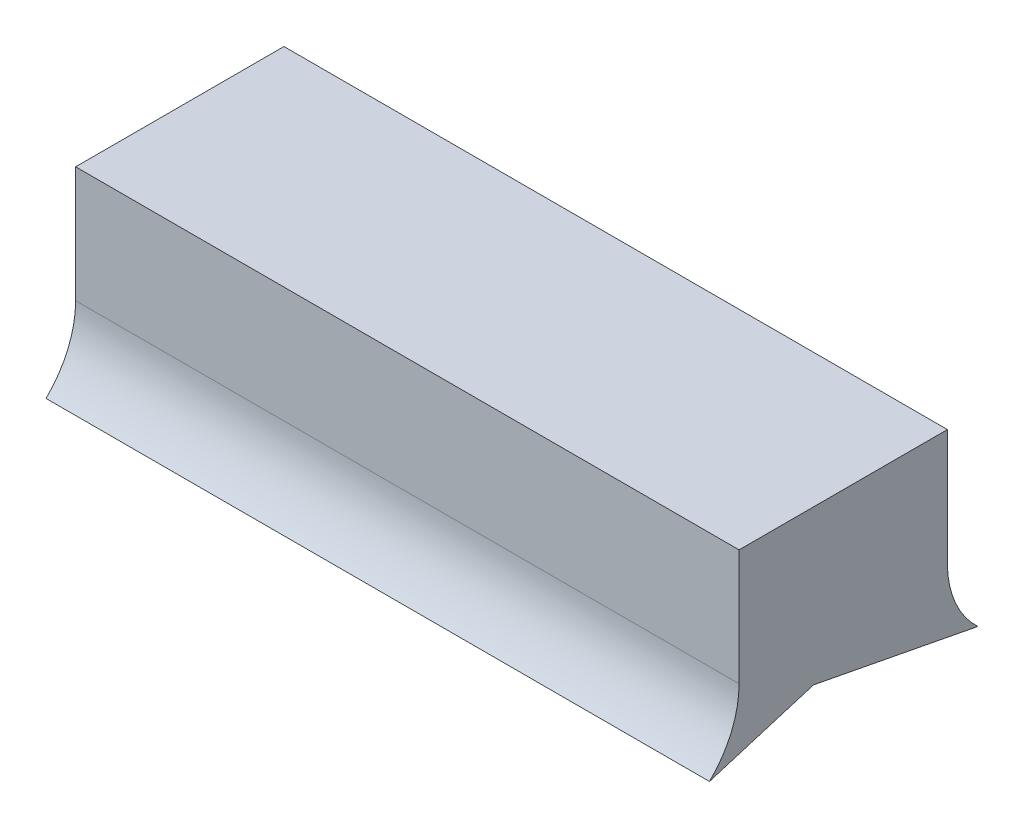
ISO-10303-21;
HEADER;
FILE_DESCRIPTION(('STEP AP214'),'2;1');
FILE_NAME('part.step','',(''),(''),'','','');
FILE_SCHEMA(('AUTOMOTIVE_DESIGN { 1 0 10303 214 1 1 1 1 }'));
ENDSEC;
DATA;
#1=APPLICATION_CONTEXT('core data for automotive mechanical design processes');
#2=APPLICATION_PROTOCOL_DEFINITION('international standard','automotive_design',2000,#1);
#3=PRODUCT_CONTEXT('',#1,'mechanical');
#4=PRODUCT('Part','Part','',(#3));
#5=PRODUCT_RELATED_PRODUCT_CATEGORY('part','',(#4));
#6=PRODUCT_DEFINITION_FORMATION('','',#4);
#7=PRODUCT_DEFINITION_CONTEXT('part definition',#1,'design');
#8=PRODUCT_DEFINITION('design','',#6,#7);
#9=PRODUCT_DEFINITION_SHAPE('','',#8);
#10=(LENGTH_UNIT() NAMED_UNIT(*) SI_UNIT(.MILLI.,.METRE.));
#11=(NAMED_UNIT(*) PLANE_ANGLE_UNIT() SI_UNIT($,.RADIAN.));
#12=(NAMED_UNIT(*) SI_UNIT($,.STERADIAN.) SOLID_ANGLE_UNIT());
#13=UNCERTAINTY_MEASURE_WITH_UNIT(LENGTH_MEASURE(1.E-05),#10,'distance_accuracy_value','');
#14=(GEOMETRIC_REPRESENTATION_CONTEXT(3) GLOBAL_UNCERTAINTY_ASSIGNED_CONTEXT((#13)) GLOBAL_UNIT_ASSIGNED_CONTEXT((#10,
#11,#12)) REPRESENTATION_CONTEXT('',''));
#15=CARTESIAN_POINT('',(0.,0.,0.));
#16=DIRECTION('',(0.,0.,1.));
#17=DIRECTION('',(1.,0.,0.));
#18=AXIS2_PLACEMENT_3D('',#15,#16,#17);
#19=CARTESIAN_POINT('',(170.671419331303,41.5041899340334,-98.0364451428921));
#20=DIRECTION('',(-1.,0.,0.));
#21=DIRECTION('',(0.,1.,0.));
#22=AXIS2_PLACEMENT_3D('',#19,#20,#21);
#23=PLANE('',#22);
#24=DIRECTION('',(0.,0.,1.));
#25=VECTOR('',#24,1.);
#26=CARTESIAN_POINT('',(170.671419331303,69.1541899340334,-121.186445142892));
#27=LINE('',#26,#25);
#28=CARTESIAN_POINT('',(170.671419331303,69.1541899340334,-170.862073157747));
#29=VERTEX_POINT('',#28);
#30=CARTESIAN_POINT('',(170.671419331303,69.1541899340334,-121.186445142892));
#31=VERTEX_POINT('',#30);
#32=EDGE_CURVE('E45',#29,#31,#27,.T.);
#33=ORIENTED_EDGE('',*,*,#32,.F.);
#34=DIRECTION('',(0.,1.,0.));
#35=VECTOR('',#34,1.);
#36=CARTESIAN_POINT('',(170.671419331303,69.1541899340333,-170.862073157747));
#37=LINE('',#36,#35);
#38=CARTESIAN_POINT('',(170.671419331303,41.5041899340334,-170.862073157747));
#39=VERTEX_POINT('',#38);
#40=EDGE_CURVE('E125',#39,#29,#37,.T.);
#41=ORIENTED_EDGE('',*,*,#40,.F.);
#42=CARTESIAN_POINT('',(170.671419331303,41.5041899340333,-193.512073157747));
#43=DIRECTION('',(-1.,0.,0.));
#44=DIRECTION('',(0.,-1.,0.));
#45=AXIS2_PLACEMENT_3D('',#42,#43,#44);
#46=CIRCLE('',#45,22.65);
#47=CARTESIAN_POINT('',(170.671419331303,24.8541899340334,-178.156292487263));
#48=VERTEX_POINT('',#47);
#49=EDGE_CURVE('E129',#48,#39,#46,.T.);
#50=ORIENTED_EDGE('',*,*,#49,.F.);
#51=DIRECTION('',(0.,-0.188677963490101,-0.9820390145474));
#52=VECTOR('',#51,1.);
#53=CARTESIAN_POINT('',(170.671419331303,32.389389728341,-138.936767093096));
#54=LINE('',#53,#52);
#55=CARTESIAN_POINT('',(170.671419331303,32.389389728341,-138.936767093096));
#56=VERTEX_POINT('',#55);
#57=EDGE_CURVE('E133',#56,#48,#54,.T.);
#58=ORIENTED_EDGE('',*,*,#57,.F.);
#59=DIRECTION('',(0.,0.290542331892302,-0.956862139170833));
#60=VECTOR('',#59,1.);
#61=CARTESIAN_POINT('',(170.671419331303,24.8541899340333,-114.120598835269));
#62=LINE('',#61,#60);
#63=CARTESIAN_POINT('',(170.671419331303,24.8541899340334,-114.120598835269));
#64=VERTEX_POINT('',#63);
#65=EDGE_CURVE('E77',#64,#56,#62,.T.);
#66=ORIENTED_EDGE('',*,*,#65,.F.);
#67=CARTESIAN_POINT('',(170.671419331303,41.5041899340334,-98.0364451428921));
#68=DIRECTION('',(-1.,0.,0.));
#69=DIRECTION('',(0.,-1.,0.));
#70=AXIS2_PLACEMENT_3D('',#67,#68,#69);
#71=CIRCLE('',#70,23.15);
#72=CARTESIAN_POINT('',(170.671419331303,41.5041899340334,-121.186445142892));
#73=VERTEX_POINT('',#72);
#74=EDGE_CURVE('E82',#73,#64,#71,.T.);
#75=ORIENTED_EDGE('',*,*,#74,.F.);
#76=DIRECTION('',(0.,-1.,0.));
#77=VECTOR('',#76,1.);
#78=CARTESIAN_POINT('',(170.671419331303,69.1541899340333,-121.186445142892));
#79=LINE('',#78,#77);
#80=EDGE_CURVE('E106',#31,#73,#79,.T.);
#81=ORIENTED_EDGE('',*,*,#80,.F.);
#82=EDGE_LOOP('',(#33,#41,#50,#58,#66,#75,#81));
#83=FACE_BOUND('',#82,.T.);
#84=ADVANCED_FACE('F37',(#83),#23,.T.);
#85=CARTESIAN_POINT('',(328.871419331303,41.5041899340334,-193.512073157747));
#86=DIRECTION('',(1.,0.,0.));
#87=DIRECTION('',(0.,1.,0.));
#88=AXIS2_PLACEMENT_3D('',#85,#86,#87);
#89=PLANE('',#88);
#90=DIRECTION('',(0.,0.,1.));
#91=VECTOR('',#90,1.);
#92=CARTESIAN_POINT('',(328.871419331303,69.1541899340334,-121.186445142892));
#93=LINE('',#92,#91);
#94=CARTESIAN_POINT('',(328.871419331303,69.1541899340334,-170.862073157747));
#95=VERTEX_POINT('',#94);
#96=CARTESIAN_POINT('',(328.871419331303,69.1541899340334,-121.186445142892));
#97=VERTEX_POINT('',#96);
#98=EDGE_CURVE('E116',#95,#97,#93,.T.);
#99=ORIENTED_EDGE('',*,*,#98,.T.);
#100=DIRECTION('',(0.,-1.,0.));
#101=VECTOR('',#100,1.);
#102=CARTESIAN_POINT('',(328.871419331303,69.1541899340334,-121.186445142892));
#103=LINE('',#102,#101);
#104=CARTESIAN_POINT('',(328.871419331303,41.5041899340335,-121.186445142892));
#105=VERTEX_POINT('',#104);
#106=EDGE_CURVE('E104',#97,#105,#103,.T.);
#107=ORIENTED_EDGE('',*,*,#106,.T.);
#108=CARTESIAN_POINT('',(328.871419331303,41.5041899340335,-98.0364451428922));
#109=DIRECTION('',(-1.,0.,0.));
#110=DIRECTION('',(0.,-1.,0.));
#111=AXIS2_PLACEMENT_3D('',#108,#109,#110);
#112=CIRCLE('',#111,23.15);
#113=CARTESIAN_POINT('',(328.871419331303,24.8541899340334,-114.120598835269));
#114=VERTEX_POINT('',#113);
#115=EDGE_CURVE('E108',#105,#114,#112,.T.);
#116=ORIENTED_EDGE('',*,*,#115,.T.);
#117=DIRECTION('',(0.,0.290542331892302,-0.956862139170833));
#118=VECTOR('',#117,1.);
#119=CARTESIAN_POINT('',(328.871419331303,24.8541899340334,-114.120598835269));
#120=LINE('',#119,#118);
#121=CARTESIAN_POINT('',(328.871419331303,32.3893897283411,-138.936767093096));
#122=VERTEX_POINT('',#121);
#123=EDGE_CURVE('E112',#114,#122,#120,.T.);
#124=ORIENTED_EDGE('',*,*,#123,.T.);
#125=DIRECTION('',(0.,-0.188677963490101,-0.9820390145474));
#126=VECTOR('',#125,1.);
#127=CARTESIAN_POINT('',(328.871419331303,32.3893897283411,-138.936767093096));
#128=LINE('',#127,#126);
#129=CARTESIAN_POINT('',(328.871419331303,24.8541899340334,-178.156292487263));
#130=VERTEX_POINT('',#129);
#131=EDGE_CURVE('E149',#122,#130,#128,.T.);
#132=ORIENTED_EDGE('',*,*,#131,.T.);
#133=CARTESIAN_POINT('',(328.871419331303,41.5041899340334,-193.512073157747));
#134=DIRECTION('',(-1.,0.,0.));
#135=DIRECTION('',(0.,1.,0.));
#136=AXIS2_PLACEMENT_3D('',#133,#134,#135);
#137=CIRCLE('',#136,22.65);
#138=CARTESIAN_POINT('',(328.871419331303,41.5041899340334,-170.862073157747));
#139=VERTEX_POINT('',#138);
#140=EDGE_CURVE('E154',#130,#139,#137,.T.);
#141=ORIENTED_EDGE('',*,*,#140,.T.);
#142=DIRECTION('',(0.,1.,0.));
#143=VECTOR('',#142,1.);
#144=CARTESIAN_POINT('',(328.871419331303,69.1541899340334,-170.862073157747));
#145=LINE('',#144,#143);
#146=EDGE_CURVE('E122',#139,#95,#145,.T.);
#147=ORIENTED_EDGE('',*,*,#146,.T.);
#148=EDGE_LOOP('',(#99,#107,#116,#124,#132,#141,#147));
#149=FACE_BOUND('',#148,.T.);
#150=ADVANCED_FACE('F114',(#149),#89,.T.);
#151=CARTESIAN_POINT('',(92.8057654042216,69.1541899340333,-121.186445142892));
#152=DIRECTION('',(0.,0.,1.));
#153=DIRECTION('',(1.,0.,0.));
#154=AXIS2_PLACEMENT_3D('',#151,#152,#153);
#155=PLANE('',#154);
#156=DIRECTION('',(1.,0.,0.));
#157=VECTOR('',#156,1.);
#158=CARTESIAN_POINT('',(92.8057654042216,69.1541899340333,-121.186445142892));
#159=LINE('',#158,#157);
#160=EDGE_CURVE('E11',#31,#97,#159,.T.);
#161=ORIENTED_EDGE('',*,*,#160,.F.);
#162=ORIENTED_EDGE('',*,*,#80,.T.);
#163=DIRECTION('',(1.,0.,0.));
#164=VECTOR('',#163,1.);
#165=CARTESIAN_POINT('',(92.8057654042216,41.5041899340334,-121.186445142892));
#166=LINE('',#165,#164);
#167=EDGE_CURVE('E101',#73,#105,#166,.T.);
#168=ORIENTED_EDGE('',*,*,#167,.T.);
#169=ORIENTED_EDGE('',*,*,#106,.F.);
#170=EDGE_LOOP('',(#161,#162,#168,#169));
#171=FACE_BOUND('',#170,.T.);
#172=ADVANCED_FACE('F102',(#171),#155,.T.);
#173=CARTESIAN_POINT('',(92.8057654042216,41.5041899340334,-98.0364451428921));
#174=DIRECTION('',(1.,0.,0.));
#175=DIRECTION('',(0.,1.,0.));
#176=AXIS2_PLACEMENT_3D('',#173,#174,#175);
#177=CYLINDRICAL_SURFACE('',#176,23.15);
#178=ORIENTED_EDGE('',*,*,#167,.F.);
#179=ORIENTED_EDGE('',*,*,#74,.T.);
#180=DIRECTION('',(1.,0.,0.));
#181=VECTOR('',#180,1.);
#182=CARTESIAN_POINT('',(92.8057654042216,24.8541899340333,-114.120598835269));
#183=LINE('',#182,#181);
#184=EDGE_CURVE('E96',#64,#114,#183,.T.);
#185=ORIENTED_EDGE('',*,*,#184,.T.);
#186=ORIENTED_EDGE('',*,*,#115,.F.);
#187=EDGE_LOOP('',(#178,#179,#185,#186));
#188=FACE_BOUND('',#187,.T.);
#189=ADVANCED_FACE('F109',(#188),#177,.F.);
#190=CARTESIAN_POINT('',(92.8057654042216,24.8541899340333,-114.120598835269));
#191=DIRECTION('',(0.,-0.956862139170833,-0.290542331892302));
#192=DIRECTION('',(0.,0.290542331892302,-0.956862139170833));
#193=AXIS2_PLACEMENT_3D('',#190,#191,#192);
#194=PLANE('',#193);
#195=ORIENTED_EDGE('',*,*,#184,.F.);
#196=ORIENTED_EDGE('',*,*,#65,.T.);
#197=DIRECTION('',(1.,0.,0.));
#198=VECTOR('',#197,1.);
#199=CARTESIAN_POINT('',(92.8057654042216,32.389389728341,-138.936767093096));
#200=LINE('',#199,#198);
#201=EDGE_CURVE('E136',#56,#122,#200,.T.);
#202=ORIENTED_EDGE('',*,*,#201,.T.);
#203=ORIENTED_EDGE('',*,*,#123,.F.);
#204=EDGE_LOOP('',(#195,#196,#202,#203));
#205=FACE_BOUND('',#204,.T.);
#206=ADVANCED_FACE('F146',(#205),#194,.T.);
#207=CARTESIAN_POINT('',(92.8057654042216,32.389389728341,-138.936767093096));
#208=DIRECTION('',(0.,-0.9820390145474,0.188677963490101));
#209=DIRECTION('',(0.,-0.188677963490101,-0.9820390145474));
#210=AXIS2_PLACEMENT_3D('',#207,#208,#209);
#211=PLANE('',#210);
#212=ORIENTED_EDGE('',*,*,#201,.F.);
#213=ORIENTED_EDGE('',*,*,#57,.T.);
#214=DIRECTION('',(1.,0.,0.));
#215=VECTOR('',#214,1.);
#216=CARTESIAN_POINT('',(92.8057654042216,24.8541899340333,-178.156292487263));
#217=LINE('',#216,#215);
#218=EDGE_CURVE('E132',#48,#130,#217,.T.);
#219=ORIENTED_EDGE('',*,*,#218,.T.);
#220=ORIENTED_EDGE('',*,*,#131,.F.);
#221=EDGE_LOOP('',(#212,#213,#219,#220));
#222=FACE_BOUND('',#221,.T.);
#223=ADVANCED_FACE('F150',(#222),#211,.T.);
#224=CARTESIAN_POINT('',(92.8057654042216,41.5041899340333,-193.512073157747));
#225=DIRECTION('',(1.,0.,0.));
#226=DIRECTION('',(0.,1.,0.));
#227=AXIS2_PLACEMENT_3D('',#224,#225,#226);
#228=CYLINDRICAL_SURFACE('',#227,22.65);
#229=ORIENTED_EDGE('',*,*,#218,.F.);
#230=ORIENTED_EDGE('',*,*,#49,.T.);
#231=DIRECTION('',(1.,0.,0.));
#232=VECTOR('',#231,1.);
#233=CARTESIAN_POINT('',(92.8057654042216,41.5041899340333,-170.862073157747));
#234=LINE('',#233,#232);
#235=EDGE_CURVE('E128',#39,#139,#234,.T.);
#236=ORIENTED_EDGE('',*,*,#235,.T.);
#237=ORIENTED_EDGE('',*,*,#140,.F.);
#238=EDGE_LOOP('',(#229,#230,#236,#237));
#239=FACE_BOUND('',#238,.T.);
#240=ADVANCED_FACE('F169',(#239),#228,.F.);
#241=CARTESIAN_POINT('',(92.8057654042216,69.1541899340333,-170.862073157747));
#242=DIRECTION('',(0.,0.,-1.));
#243=DIRECTION('',(-1.,0.,0.));
#244=AXIS2_PLACEMENT_3D('',#241,#242,#243);
#245=PLANE('',#244);
#246=ORIENTED_EDGE('',*,*,#235,.F.);
#247=ORIENTED_EDGE('',*,*,#40,.T.);
#248=DIRECTION('',(1.,0.,0.));
#249=VECTOR('',#248,1.);
#250=CARTESIAN_POINT('',(92.8057654042216,69.1541899340333,-170.862073157747));
#251=LINE('',#250,#249);
#252=EDGE_CURVE('E124',#29,#95,#251,.T.);
#253=ORIENTED_EDGE('',*,*,#252,.T.);
#254=ORIENTED_EDGE('',*,*,#146,.F.);
#255=EDGE_LOOP('',(#246,#247,#253,#254));
#256=FACE_BOUND('',#255,.T.);
#257=ADVANCED_FACE('F161',(#256),#245,.T.);
#258=CARTESIAN_POINT('',(92.8057654042216,69.1541899340333,-121.186445142892));
#259=DIRECTION('',(0.,1.,0.));
#260=DIRECTION('',(-1.,0.,0.));
#261=AXIS2_PLACEMENT_3D('',#258,#259,#260);
#262=PLANE('',#261);
#263=ORIENTED_EDGE('',*,*,#252,.F.);
#264=ORIENTED_EDGE('',*,*,#32,.T.);
#265=ORIENTED_EDGE('',*,*,#160,.T.);
#266=ORIENTED_EDGE('',*,*,#98,.F.);
#267=EDGE_LOOP('',(#263,#264,#265,#266));
#268=FACE_BOUND('',#267,.T.);
#269=ADVANCED_FACE('F163',(#268),#262,.T.);
#270=CLOSED_SHELL('',(#84,#150,#172,#189,#206,#223,#240,#257,#269));
#271=MANIFOLD_SOLID_BREP('B2',#270);
#272=ADVANCED_BREP_SHAPE_REPRESENTATION('',(#18,#271),#14);
#273=SHAPE_DEFINITION_REPRESENTATION(#9,#272);
ENDSEC;
END-ISO-10303-21;
